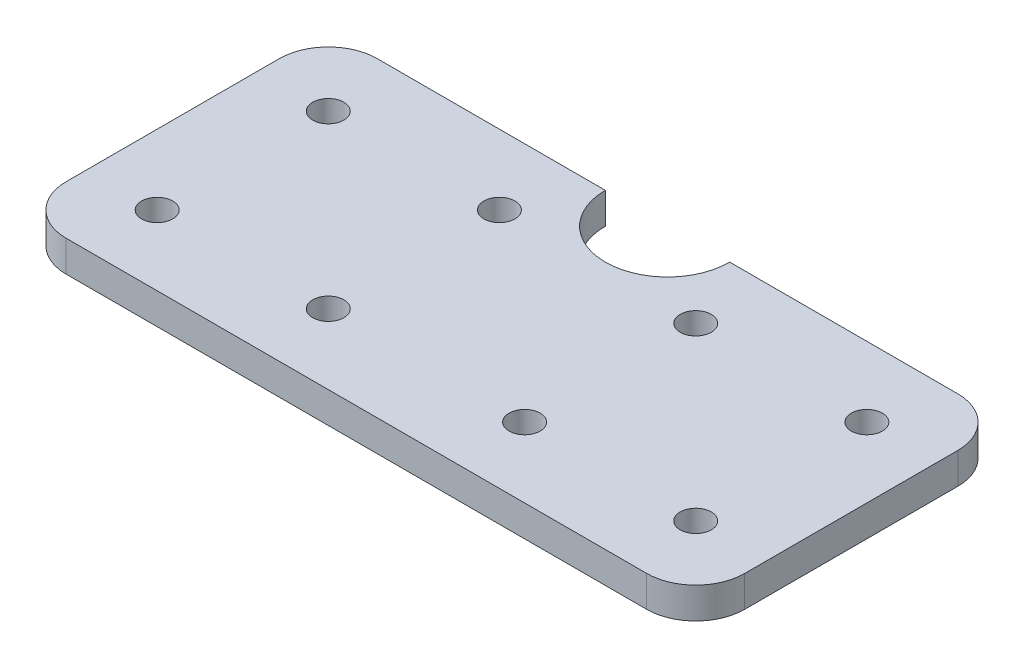
ISO-10303-21;
HEADER;
FILE_DESCRIPTION(('STEP AP214'),'2;1');
FILE_NAME('part.step','',(''),(''),'','','');
FILE_SCHEMA(('AUTOMOTIVE_DESIGN { 1 0 10303 214 1 1 1 1 }'));
ENDSEC;
DATA;
#1=APPLICATION_CONTEXT('core data for automotive mechanical design processes');
#2=APPLICATION_PROTOCOL_DEFINITION('international standard','automotive_design',2000,#1);
#3=PRODUCT_CONTEXT('',#1,'mechanical');
#4=PRODUCT('Part','Part','',(#3));
#5=PRODUCT_RELATED_PRODUCT_CATEGORY('part','',(#4));
#6=PRODUCT_DEFINITION_FORMATION('','',#4);
#7=PRODUCT_DEFINITION_CONTEXT('part definition',#1,'design');
#8=PRODUCT_DEFINITION('design','',#6,#7);
#9=PRODUCT_DEFINITION_SHAPE('','',#8);
#10=(LENGTH_UNIT() NAMED_UNIT(*) SI_UNIT(.MILLI.,.METRE.));
#11=(NAMED_UNIT(*) PLANE_ANGLE_UNIT() SI_UNIT($,.RADIAN.));
#12=(NAMED_UNIT(*) SI_UNIT($,.STERADIAN.) SOLID_ANGLE_UNIT());
#13=UNCERTAINTY_MEASURE_WITH_UNIT(LENGTH_MEASURE(1.E-05),#10,'distance_accuracy_value','');
#14=(GEOMETRIC_REPRESENTATION_CONTEXT(3) GLOBAL_UNCERTAINTY_ASSIGNED_CONTEXT((#13)) GLOBAL_UNIT_ASSIGNED_CONTEXT((#10,
#11,#12)) REPRESENTATION_CONTEXT('',''));
#15=CARTESIAN_POINT('',(0.,0.,0.));
#16=DIRECTION('',(0.,0.,1.));
#17=DIRECTION('',(1.,0.,0.));
#18=AXIS2_PLACEMENT_3D('',#15,#16,#17);
#19=CARTESIAN_POINT('',(-69.25,6.35,-31.75));
#20=DIRECTION('',(0.,0.,1.));
#21=DIRECTION('',(1.,0.,0.));
#22=AXIS2_PLACEMENT_3D('',#19,#20,#21);
#23=PLANE('',#22);
#24=DIRECTION('',(-1.,0.,0.));
#25=VECTOR('',#24,1.);
#26=CARTESIAN_POINT('',(-69.25,0.,-31.75));
#27=LINE('',#26,#25);
#28=CARTESIAN_POINT('',(59.25,0.,-31.75));
#29=VERTEX_POINT('',#28);
#30=CARTESIAN_POINT('',(12.7,0.,-31.75));
#31=VERTEX_POINT('',#30);
#32=EDGE_CURVE('E139',#29,#31,#27,.T.);
#33=ORIENTED_EDGE('',*,*,#32,.T.);
#34=DIRECTION('',(0.,1.,0.));
#35=VECTOR('',#34,1.);
#36=CARTESIAN_POINT('',(12.7,0.,-31.75));
#37=LINE('',#36,#35);
#38=CARTESIAN_POINT('',(12.7,6.35,-31.75));
#39=VERTEX_POINT('',#38);
#40=EDGE_CURVE('E55',#31,#39,#37,.T.);
#41=ORIENTED_EDGE('',*,*,#40,.T.);
#42=DIRECTION('',(-1.,0.,0.));
#43=VECTOR('',#42,1.);
#44=CARTESIAN_POINT('',(-69.25,6.35,-31.75));
#45=LINE('',#44,#43);
#46=CARTESIAN_POINT('',(59.25,6.35,-31.75));
#47=VERTEX_POINT('',#46);
#48=EDGE_CURVE('E216',#47,#39,#45,.T.);
#49=ORIENTED_EDGE('',*,*,#48,.F.);
#50=DIRECTION('',(0.,-1.,0.));
#51=VECTOR('',#50,1.);
#52=CARTESIAN_POINT('',(59.25,6.35,-31.75));
#53=LINE('',#52,#51);
#54=EDGE_CURVE('E11',#47,#29,#53,.T.);
#55=ORIENTED_EDGE('',*,*,#54,.T.);
#56=EDGE_LOOP('',(#33,#41,#49,#55));
#57=FACE_BOUND('',#56,.T.);
#58=ADVANCED_FACE('F39',(#57),#23,.F.);
#59=CARTESIAN_POINT('',(69.25,6.35,31.75));
#60=DIRECTION('',(-1.,0.,0.));
#61=DIRECTION('',(0.,0.,1.));
#62=AXIS2_PLACEMENT_3D('',#59,#60,#61);
#63=PLANE('',#62);
#64=DIRECTION('',(0.,0.,-1.));
#65=VECTOR('',#64,1.);
#66=CARTESIAN_POINT('',(69.25,6.35,31.75));
#67=LINE('',#66,#65);
#68=CARTESIAN_POINT('',(69.25,6.35,21.75));
#69=VERTEX_POINT('',#68);
#70=CARTESIAN_POINT('',(69.25,6.35,-21.75));
#71=VERTEX_POINT('',#70);
#72=EDGE_CURVE('E157',#69,#71,#67,.T.);
#73=ORIENTED_EDGE('',*,*,#72,.F.);
#74=DIRECTION('',(0.,-1.,0.));
#75=VECTOR('',#74,1.);
#76=CARTESIAN_POINT('',(69.25,6.35,21.75));
#77=LINE('',#76,#75);
#78=CARTESIAN_POINT('',(69.25,0.,21.75));
#79=VERTEX_POINT('',#78);
#80=EDGE_CURVE('E199',#69,#79,#77,.T.);
#81=ORIENTED_EDGE('',*,*,#80,.T.);
#82=DIRECTION('',(0.,0.,-1.));
#83=VECTOR('',#82,1.);
#84=CARTESIAN_POINT('',(69.25,0.,31.75));
#85=LINE('',#84,#83);
#86=CARTESIAN_POINT('',(69.25,0.,-21.75));
#87=VERTEX_POINT('',#86);
#88=EDGE_CURVE('E140',#79,#87,#85,.T.);
#89=ORIENTED_EDGE('',*,*,#88,.T.);
#90=DIRECTION('',(0.,-1.,0.));
#91=VECTOR('',#90,1.);
#92=CARTESIAN_POINT('',(69.25,6.35,-21.75));
#93=LINE('',#92,#91);
#94=EDGE_CURVE('E196',#87,#71,#93,.F.);
#95=ORIENTED_EDGE('',*,*,#94,.T.);
#96=EDGE_LOOP('',(#73,#81,#89,#95));
#97=FACE_BOUND('',#96,.T.);
#98=ADVANCED_FACE('F301',(#97),#63,.F.);
#99=CARTESIAN_POINT('',(-12.7,6.35,-31.75));
#100=VERTEX_POINT('',#99);
#101=CARTESIAN_POINT('',(-59.25,6.35,-31.75));
#102=VERTEX_POINT('',#101);
#103=EDGE_CURVE('E63',#100,#102,#45,.T.);
#104=ORIENTED_EDGE('',*,*,#103,.F.);
#105=DIRECTION('',(0.,1.,0.));
#106=VECTOR('',#105,1.);
#107=CARTESIAN_POINT('',(-12.7,0.,-31.75));
#108=LINE('',#107,#106);
#109=CARTESIAN_POINT('',(-12.7,0.,-31.75));
#110=VERTEX_POINT('',#109);
#111=EDGE_CURVE('E118',#110,#100,#108,.T.);
#112=ORIENTED_EDGE('',*,*,#111,.F.);
#113=CARTESIAN_POINT('',(-59.25,0.,-31.75));
#114=VERTEX_POINT('',#113);
#115=EDGE_CURVE('E128',#110,#114,#27,.T.);
#116=ORIENTED_EDGE('',*,*,#115,.T.);
#117=DIRECTION('',(0.,-1.,0.));
#118=VECTOR('',#117,1.);
#119=CARTESIAN_POINT('',(-59.25,6.35,-31.75));
#120=LINE('',#119,#118);
#121=EDGE_CURVE('E48',#114,#102,#120,.F.);
#122=ORIENTED_EDGE('',*,*,#121,.T.);
#123=EDGE_LOOP('',(#104,#112,#116,#122));
#124=FACE_BOUND('',#123,.T.);
#125=ADVANCED_FACE('F127',(#124),#23,.F.);
#126=CARTESIAN_POINT('',(-69.25,6.35,31.75));
#127=DIRECTION('',(1.,0.,0.));
#128=DIRECTION('',(0.,0.,-1.));
#129=AXIS2_PLACEMENT_3D('',#126,#127,#128);
#130=PLANE('',#129);
#131=DIRECTION('',(0.,0.,1.));
#132=VECTOR('',#131,1.);
#133=CARTESIAN_POINT('',(-69.25,0.,31.75));
#134=LINE('',#133,#132);
#135=CARTESIAN_POINT('',(-69.25,0.,-21.75));
#136=VERTEX_POINT('',#135);
#137=CARTESIAN_POINT('',(-69.25,0.,21.75));
#138=VERTEX_POINT('',#137);
#139=EDGE_CURVE('E144',#136,#138,#134,.T.);
#140=ORIENTED_EDGE('',*,*,#139,.T.);
#141=DIRECTION('',(0.,-1.,0.));
#142=VECTOR('',#141,1.);
#143=CARTESIAN_POINT('',(-69.25,6.35,21.75));
#144=LINE('',#143,#142);
#145=CARTESIAN_POINT('',(-69.25,6.35,21.75));
#146=VERTEX_POINT('',#145);
#147=EDGE_CURVE('E181',#138,#146,#144,.F.);
#148=ORIENTED_EDGE('',*,*,#147,.T.);
#149=DIRECTION('',(0.,0.,1.));
#150=VECTOR('',#149,1.);
#151=CARTESIAN_POINT('',(-69.25,6.35,31.75));
#152=LINE('',#151,#150);
#153=CARTESIAN_POINT('',(-69.25,6.35,-21.75));
#154=VERTEX_POINT('',#153);
#155=EDGE_CURVE('E210',#154,#146,#152,.T.);
#156=ORIENTED_EDGE('',*,*,#155,.F.);
#157=DIRECTION('',(0.,-1.,0.));
#158=VECTOR('',#157,1.);
#159=CARTESIAN_POINT('',(-69.25,6.35,-21.75));
#160=LINE('',#159,#158);
#161=EDGE_CURVE('E177',#154,#136,#160,.T.);
#162=ORIENTED_EDGE('',*,*,#161,.T.);
#163=EDGE_LOOP('',(#140,#148,#156,#162));
#164=FACE_BOUND('',#163,.T.);
#165=ADVANCED_FACE('F213',(#164),#130,.F.);
#166=CARTESIAN_POINT('',(-69.25,6.35,31.75));
#167=DIRECTION('',(0.,0.,-1.));
#168=DIRECTION('',(-1.,0.,0.));
#169=AXIS2_PLACEMENT_3D('',#166,#167,#168);
#170=PLANE('',#169);
#171=DIRECTION('',(1.,0.,0.));
#172=VECTOR('',#171,1.);
#173=CARTESIAN_POINT('',(-69.25,6.35,31.75));
#174=LINE('',#173,#172);
#175=CARTESIAN_POINT('',(-59.25,6.35,31.75));
#176=VERTEX_POINT('',#175);
#177=CARTESIAN_POINT('',(59.25,6.35,31.75));
#178=VERTEX_POINT('',#177);
#179=EDGE_CURVE('E162',#176,#178,#174,.T.);
#180=ORIENTED_EDGE('',*,*,#179,.F.);
#181=DIRECTION('',(0.,-1.,0.));
#182=VECTOR('',#181,1.);
#183=CARTESIAN_POINT('',(-59.25,6.35,31.75));
#184=LINE('',#183,#182);
#185=CARTESIAN_POINT('',(-59.25,0.,31.75));
#186=VERTEX_POINT('',#185);
#187=EDGE_CURVE('E161',#176,#186,#184,.T.);
#188=ORIENTED_EDGE('',*,*,#187,.T.);
#189=DIRECTION('',(1.,0.,0.));
#190=VECTOR('',#189,1.);
#191=CARTESIAN_POINT('',(-69.25,0.,31.75));
#192=LINE('',#191,#190);
#193=CARTESIAN_POINT('',(59.25,0.,31.75));
#194=VERTEX_POINT('',#193);
#195=EDGE_CURVE('E153',#186,#194,#192,.T.);
#196=ORIENTED_EDGE('',*,*,#195,.T.);
#197=DIRECTION('',(0.,-1.,0.));
#198=VECTOR('',#197,1.);
#199=CARTESIAN_POINT('',(59.25,6.35,31.75));
#200=LINE('',#199,#198);
#201=EDGE_CURVE('E158',#194,#178,#200,.F.);
#202=ORIENTED_EDGE('',*,*,#201,.T.);
#203=EDGE_LOOP('',(#180,#188,#196,#202));
#204=FACE_BOUND('',#203,.T.);
#205=ADVANCED_FACE('F310',(#204),#170,.F.);
#206=CARTESIAN_POINT('',(0.,6.35,0.));
#207=DIRECTION('',(0.,-1.,0.));
#208=DIRECTION('',(0.,0.,-1.));
#209=AXIS2_PLACEMENT_3D('',#206,#207,#208);
#210=PLANE('',#209);
#211=CARTESIAN_POINT('',(-20.0375,6.35,-17.4625));
#212=DIRECTION('',(0.,1.,0.));
#213=DIRECTION('',(0.,0.,1.));
#214=AXIS2_PLACEMENT_3D('',#211,#212,#213);
#215=CIRCLE('',#214,3.175);
#216=CARTESIAN_POINT('',(-20.0375,6.35,-14.2875));
#217=VERTEX_POINT('',#216);
#218=EDGE_CURVE('E259',#217,#217,#215,.T.);
#219=ORIENTED_EDGE('',*,*,#218,.F.);
#220=EDGE_LOOP('',(#219));
#221=FACE_BOUND('',#220,.T.);
#222=CARTESIAN_POINT('',(20.0375,6.35,-17.4625));
#223=DIRECTION('',(0.,1.,0.));
#224=DIRECTION('',(0.,0.,-1.));
#225=AXIS2_PLACEMENT_3D('',#222,#223,#224);
#226=CIRCLE('',#225,3.175);
#227=CARTESIAN_POINT('',(20.0375,6.35,-20.6375));
#228=VERTEX_POINT('',#227);
#229=EDGE_CURVE('E251',#228,#228,#226,.T.);
#230=ORIENTED_EDGE('',*,*,#229,.F.);
#231=EDGE_LOOP('',(#230));
#232=FACE_BOUND('',#231,.T.);
#233=CARTESIAN_POINT('',(54.9625,6.35,-17.4625));
#234=DIRECTION('',(0.,1.,0.));
#235=DIRECTION('',(0.,0.,-1.));
#236=AXIS2_PLACEMENT_3D('',#233,#234,#235);
#237=CIRCLE('',#236,3.175);
#238=CARTESIAN_POINT('',(54.9625,6.35,-20.6375));
#239=VERTEX_POINT('',#238);
#240=EDGE_CURVE('E243',#239,#239,#237,.T.);
#241=ORIENTED_EDGE('',*,*,#240,.F.);
#242=EDGE_LOOP('',(#241));
#243=FACE_BOUND('',#242,.T.);
#244=CARTESIAN_POINT('',(54.9625,6.35,17.4625));
#245=DIRECTION('',(0.,1.,0.));
#246=DIRECTION('',(0.,0.,1.));
#247=AXIS2_PLACEMENT_3D('',#244,#245,#246);
#248=CIRCLE('',#247,3.175);
#249=CARTESIAN_POINT('',(54.9625,6.35,20.6375));
#250=VERTEX_POINT('',#249);
#251=EDGE_CURVE('E234',#250,#250,#248,.T.);
#252=ORIENTED_EDGE('',*,*,#251,.F.);
#253=EDGE_LOOP('',(#252));
#254=FACE_BOUND('',#253,.T.);
#255=CARTESIAN_POINT('',(20.0375,6.35,17.4625));
#256=DIRECTION('',(0.,1.,0.));
#257=DIRECTION('',(0.,0.,1.));
#258=AXIS2_PLACEMENT_3D('',#255,#256,#257);
#259=CIRCLE('',#258,3.175);
#260=CARTESIAN_POINT('',(20.0375,6.35,20.6375));
#261=VERTEX_POINT('',#260);
#262=EDGE_CURVE('E281',#261,#261,#259,.T.);
#263=ORIENTED_EDGE('',*,*,#262,.F.);
#264=EDGE_LOOP('',(#263));
#265=FACE_BOUND('',#264,.T.);
#266=CARTESIAN_POINT('',(-20.0375,6.35,17.4625));
#267=DIRECTION('',(0.,1.,0.));
#268=DIRECTION('',(0.,0.,-1.));
#269=AXIS2_PLACEMENT_3D('',#266,#267,#268);
#270=CIRCLE('',#269,3.175);
#271=CARTESIAN_POINT('',(-20.0375,6.35,14.2875));
#272=VERTEX_POINT('',#271);
#273=EDGE_CURVE('E273',#272,#272,#270,.T.);
#274=ORIENTED_EDGE('',*,*,#273,.F.);
#275=EDGE_LOOP('',(#274));
#276=FACE_BOUND('',#275,.T.);
#277=CARTESIAN_POINT('',(-54.9625,6.35,17.4625));
#278=DIRECTION('',(0.,1.,0.));
#279=DIRECTION('',(0.,0.,-1.));
#280=AXIS2_PLACEMENT_3D('',#277,#278,#279);
#281=CIRCLE('',#280,3.175);
#282=CARTESIAN_POINT('',(-54.9625,6.35,14.2875));
#283=VERTEX_POINT('',#282);
#284=EDGE_CURVE('E131',#283,#283,#281,.T.);
#285=ORIENTED_EDGE('',*,*,#284,.F.);
#286=EDGE_LOOP('',(#285));
#287=FACE_BOUND('',#286,.T.);
#288=CARTESIAN_POINT('',(-54.9625,6.35,-17.4625));
#289=DIRECTION('',(0.,1.,0.));
#290=DIRECTION('',(0.,0.,1.));
#291=AXIS2_PLACEMENT_3D('',#288,#289,#290);
#292=CIRCLE('',#291,3.175);
#293=CARTESIAN_POINT('',(-54.9625,6.35,-14.2875));
#294=VERTEX_POINT('',#293);
#295=EDGE_CURVE('E226',#294,#294,#292,.T.);
#296=ORIENTED_EDGE('',*,*,#295,.F.);
#297=EDGE_LOOP('',(#296));
#298=FACE_BOUND('',#297,.T.);
#299=ORIENTED_EDGE('',*,*,#48,.T.);
#300=CARTESIAN_POINT('',(0.,6.35,-31.75));
#301=DIRECTION('',(0.,1.,0.));
#302=DIRECTION('',(0.,0.,-1.));
#303=AXIS2_PLACEMENT_3D('',#300,#301,#302);
#304=CIRCLE('',#303,12.7);
#305=EDGE_CURVE('E124',#100,#39,#304,.T.);
#306=ORIENTED_EDGE('',*,*,#305,.F.);
#307=ORIENTED_EDGE('',*,*,#103,.T.);
#308=CARTESIAN_POINT('',(-59.25,6.35,-21.75));
#309=DIRECTION('',(0.,-1.,0.));
#310=DIRECTION('',(0.,0.,-1.));
#311=AXIS2_PLACEMENT_3D('',#308,#309,#310);
#312=CIRCLE('',#311,10.);
#313=EDGE_CURVE('E184',#102,#154,#312,.F.);
#314=ORIENTED_EDGE('',*,*,#313,.T.);
#315=ORIENTED_EDGE('',*,*,#155,.T.);
#316=CARTESIAN_POINT('',(-59.25,6.35,21.75));
#317=DIRECTION('',(0.,-1.,0.));
#318=DIRECTION('',(0.,0.,-1.));
#319=AXIS2_PLACEMENT_3D('',#316,#317,#318);
#320=CIRCLE('',#319,10.);
#321=EDGE_CURVE('E193',#146,#176,#320,.F.);
#322=ORIENTED_EDGE('',*,*,#321,.T.);
#323=ORIENTED_EDGE('',*,*,#179,.T.);
#324=CARTESIAN_POINT('',(59.25,6.35,21.75));
#325=DIRECTION('',(0.,-1.,0.));
#326=DIRECTION('',(0.,0.,-1.));
#327=AXIS2_PLACEMENT_3D('',#324,#325,#326);
#328=CIRCLE('',#327,10.);
#329=EDGE_CURVE('E190',#178,#69,#328,.F.);
#330=ORIENTED_EDGE('',*,*,#329,.T.);
#331=ORIENTED_EDGE('',*,*,#72,.T.);
#332=CARTESIAN_POINT('',(59.25,6.35,-21.75));
#333=DIRECTION('',(0.,-1.,0.));
#334=DIRECTION('',(0.,0.,-1.));
#335=AXIS2_PLACEMENT_3D('',#332,#333,#334);
#336=CIRCLE('',#335,10.);
#337=EDGE_CURVE('E187',#71,#47,#336,.F.);
#338=ORIENTED_EDGE('',*,*,#337,.T.);
#339=EDGE_LOOP('',(#299,#306,#307,#314,#315,#322,#323,#330,#331,#338));
#340=FACE_BOUND('',#339,.T.);
#341=ADVANCED_FACE('F209',(#221,#232,#243,#254,#265,#276,#287,#298,#340),#210,.F.);
#342=CARTESIAN_POINT('',(0.,0.,0.));
#343=DIRECTION('',(0.,-1.,0.));
#344=DIRECTION('',(0.,0.,-1.));
#345=AXIS2_PLACEMENT_3D('',#342,#343,#344);
#346=PLANE('',#345);
#347=CARTESIAN_POINT('',(0.,0.,-31.75));
#348=DIRECTION('',(0.,1.,0.));
#349=DIRECTION('',(0.,0.,-1.));
#350=AXIS2_PLACEMENT_3D('',#347,#348,#349);
#351=CIRCLE('',#350,12.7);
#352=EDGE_CURVE('E115',#110,#31,#351,.T.);
#353=ORIENTED_EDGE('',*,*,#352,.T.);
#354=ORIENTED_EDGE('',*,*,#32,.F.);
#355=CARTESIAN_POINT('',(59.25,0.,-21.75));
#356=DIRECTION('',(0.,-1.,0.));
#357=DIRECTION('',(0.,0.,-1.));
#358=AXIS2_PLACEMENT_3D('',#355,#356,#357);
#359=CIRCLE('',#358,10.);
#360=EDGE_CURVE('E168',#29,#87,#359,.T.);
#361=ORIENTED_EDGE('',*,*,#360,.T.);
#362=ORIENTED_EDGE('',*,*,#88,.F.);
#363=CARTESIAN_POINT('',(59.25,0.,21.75));
#364=DIRECTION('',(0.,-1.,0.));
#365=DIRECTION('',(0.,0.,-1.));
#366=AXIS2_PLACEMENT_3D('',#363,#364,#365);
#367=CIRCLE('',#366,10.);
#368=EDGE_CURVE('E171',#79,#194,#367,.T.);
#369=ORIENTED_EDGE('',*,*,#368,.T.);
#370=ORIENTED_EDGE('',*,*,#195,.F.);
#371=CARTESIAN_POINT('',(-59.25,0.,21.75));
#372=DIRECTION('',(0.,-1.,0.));
#373=DIRECTION('',(0.,0.,-1.));
#374=AXIS2_PLACEMENT_3D('',#371,#372,#373);
#375=CIRCLE('',#374,10.);
#376=EDGE_CURVE('E174',#186,#138,#375,.T.);
#377=ORIENTED_EDGE('',*,*,#376,.T.);
#378=ORIENTED_EDGE('',*,*,#139,.F.);
#379=CARTESIAN_POINT('',(-59.25,0.,-21.75));
#380=DIRECTION('',(0.,-1.,0.));
#381=DIRECTION('',(0.,0.,-1.));
#382=AXIS2_PLACEMENT_3D('',#379,#380,#381);
#383=CIRCLE('',#382,10.);
#384=EDGE_CURVE('E136',#136,#114,#383,.T.);
#385=ORIENTED_EDGE('',*,*,#384,.T.);
#386=ORIENTED_EDGE('',*,*,#115,.F.);
#387=EDGE_LOOP('',(#353,#354,#361,#362,#369,#370,#377,#378,#385,#386));
#388=FACE_BOUND('',#387,.T.);
#389=CARTESIAN_POINT('',(-20.0375,0.,-17.4625));
#390=DIRECTION('',(0.,1.,0.));
#391=DIRECTION('',(0.,0.,1.));
#392=AXIS2_PLACEMENT_3D('',#389,#390,#391);
#393=CIRCLE('',#392,3.175);
#394=CARTESIAN_POINT('',(-20.0375,0.,-14.2875));
#395=VERTEX_POINT('',#394);
#396=EDGE_CURVE('E230',#395,#395,#393,.T.);
#397=ORIENTED_EDGE('',*,*,#396,.T.);
#398=EDGE_LOOP('',(#397));
#399=FACE_BOUND('',#398,.T.);
#400=CARTESIAN_POINT('',(20.0375,0.,-17.4625));
#401=DIRECTION('',(0.,1.,0.));
#402=DIRECTION('',(0.,0.,-1.));
#403=AXIS2_PLACEMENT_3D('',#400,#401,#402);
#404=CIRCLE('',#403,3.175);
#405=CARTESIAN_POINT('',(20.0375,0.,-20.6375));
#406=VERTEX_POINT('',#405);
#407=EDGE_CURVE('E255',#406,#406,#404,.T.);
#408=ORIENTED_EDGE('',*,*,#407,.T.);
#409=EDGE_LOOP('',(#408));
#410=FACE_BOUND('',#409,.T.);
#411=CARTESIAN_POINT('',(54.9625,0.,-17.4625));
#412=DIRECTION('',(0.,1.,0.));
#413=DIRECTION('',(0.,0.,-1.));
#414=AXIS2_PLACEMENT_3D('',#411,#412,#413);
#415=CIRCLE('',#414,3.175);
#416=CARTESIAN_POINT('',(54.9625,0.,-20.6375));
#417=VERTEX_POINT('',#416);
#418=EDGE_CURVE('E247',#417,#417,#415,.T.);
#419=ORIENTED_EDGE('',*,*,#418,.T.);
#420=EDGE_LOOP('',(#419));
#421=FACE_BOUND('',#420,.T.);
#422=CARTESIAN_POINT('',(54.9625,0.,17.4625));
#423=DIRECTION('',(0.,1.,0.));
#424=DIRECTION('',(0.,0.,1.));
#425=AXIS2_PLACEMENT_3D('',#422,#423,#424);
#426=CIRCLE('',#425,3.175);
#427=CARTESIAN_POINT('',(54.9625,0.,20.6375));
#428=VERTEX_POINT('',#427);
#429=EDGE_CURVE('E238',#428,#428,#426,.T.);
#430=ORIENTED_EDGE('',*,*,#429,.T.);
#431=EDGE_LOOP('',(#430));
#432=FACE_BOUND('',#431,.T.);
#433=CARTESIAN_POINT('',(20.0375,0.,17.4625));
#434=DIRECTION('',(0.,1.,0.));
#435=DIRECTION('',(0.,0.,1.));
#436=AXIS2_PLACEMENT_3D('',#433,#434,#435);
#437=CIRCLE('',#436,3.175);
#438=CARTESIAN_POINT('',(20.0375,0.,20.6375));
#439=VERTEX_POINT('',#438);
#440=EDGE_CURVE('E239',#439,#439,#437,.T.);
#441=ORIENTED_EDGE('',*,*,#440,.T.);
#442=EDGE_LOOP('',(#441));
#443=FACE_BOUND('',#442,.T.);
#444=CARTESIAN_POINT('',(-20.0375,0.,17.4625));
#445=DIRECTION('',(0.,1.,0.));
#446=DIRECTION('',(0.,0.,-1.));
#447=AXIS2_PLACEMENT_3D('',#444,#445,#446);
#448=CIRCLE('',#447,3.175);
#449=CARTESIAN_POINT('',(-20.0375,0.,14.2875));
#450=VERTEX_POINT('',#449);
#451=EDGE_CURVE('E277',#450,#450,#448,.T.);
#452=ORIENTED_EDGE('',*,*,#451,.T.);
#453=EDGE_LOOP('',(#452));
#454=FACE_BOUND('',#453,.T.);
#455=CARTESIAN_POINT('',(-54.9625,0.,17.4625));
#456=DIRECTION('',(0.,1.,0.));
#457=DIRECTION('',(0.,0.,-1.));
#458=AXIS2_PLACEMENT_3D('',#455,#456,#457);
#459=CIRCLE('',#458,3.175);
#460=CARTESIAN_POINT('',(-54.9625,0.,14.2875));
#461=VERTEX_POINT('',#460);
#462=EDGE_CURVE('E269',#461,#461,#459,.T.);
#463=ORIENTED_EDGE('',*,*,#462,.T.);
#464=EDGE_LOOP('',(#463));
#465=FACE_BOUND('',#464,.T.);
#466=CARTESIAN_POINT('',(-54.9625,0.,-17.4625));
#467=DIRECTION('',(0.,1.,0.));
#468=DIRECTION('',(0.,0.,1.));
#469=AXIS2_PLACEMENT_3D('',#466,#467,#468);
#470=CIRCLE('',#469,3.175);
#471=CARTESIAN_POINT('',(-54.9625,0.,-14.2875));
#472=VERTEX_POINT('',#471);
#473=EDGE_CURVE('E146',#472,#472,#470,.T.);
#474=ORIENTED_EDGE('',*,*,#473,.T.);
#475=EDGE_LOOP('',(#474));
#476=FACE_BOUND('',#475,.T.);
#477=ADVANCED_FACE('F133',(#388,#399,#410,#421,#432,#443,#454,#465,#476),#346,.T.);
#478=CARTESIAN_POINT('',(-54.9625,0.,-17.4625));
#479=DIRECTION('',(0.,1.,0.));
#480=DIRECTION('',(0.,0.,1.));
#481=AXIS2_PLACEMENT_3D('',#478,#479,#480);
#482=CYLINDRICAL_SURFACE('',#481,3.175);
#483=ORIENTED_EDGE('',*,*,#473,.F.);
#484=EDGE_LOOP('',(#483));
#485=FACE_BOUND('',#484,.T.);
#486=ORIENTED_EDGE('',*,*,#295,.T.);
#487=EDGE_LOOP('',(#486));
#488=FACE_BOUND('',#487,.T.);
#489=ADVANCED_FACE('F343',(#485,#488),#482,.F.);
#490=CARTESIAN_POINT('',(-54.9625,0.,17.4625));
#491=DIRECTION('',(0.,1.,0.));
#492=DIRECTION('',(0.,0.,1.));
#493=AXIS2_PLACEMENT_3D('',#490,#491,#492);
#494=CYLINDRICAL_SURFACE('',#493,3.175);
#495=ORIENTED_EDGE('',*,*,#462,.F.);
#496=EDGE_LOOP('',(#495));
#497=FACE_BOUND('',#496,.T.);
#498=ORIENTED_EDGE('',*,*,#284,.T.);
#499=EDGE_LOOP('',(#498));
#500=FACE_BOUND('',#499,.T.);
#501=ADVANCED_FACE('F349',(#497,#500),#494,.F.);
#502=CARTESIAN_POINT('',(-20.0375,0.,17.4625));
#503=DIRECTION('',(0.,1.,0.));
#504=DIRECTION('',(0.,0.,1.));
#505=AXIS2_PLACEMENT_3D('',#502,#503,#504);
#506=CYLINDRICAL_SURFACE('',#505,3.175);
#507=ORIENTED_EDGE('',*,*,#451,.F.);
#508=EDGE_LOOP('',(#507));
#509=FACE_BOUND('',#508,.T.);
#510=ORIENTED_EDGE('',*,*,#273,.T.);
#511=EDGE_LOOP('',(#510));
#512=FACE_BOUND('',#511,.T.);
#513=ADVANCED_FACE('F365',(#509,#512),#506,.F.);
#514=CARTESIAN_POINT('',(20.0375,0.,17.4625));
#515=DIRECTION('',(0.,1.,0.));
#516=DIRECTION('',(0.,0.,1.));
#517=AXIS2_PLACEMENT_3D('',#514,#515,#516);
#518=CYLINDRICAL_SURFACE('',#517,3.175);
#519=ORIENTED_EDGE('',*,*,#440,.F.);
#520=EDGE_LOOP('',(#519));
#521=FACE_BOUND('',#520,.T.);
#522=ORIENTED_EDGE('',*,*,#262,.T.);
#523=EDGE_LOOP('',(#522));
#524=FACE_BOUND('',#523,.T.);
#525=ADVANCED_FACE('F355',(#521,#524),#518,.F.);
#526=CARTESIAN_POINT('',(54.9625,0.,17.4625));
#527=DIRECTION('',(0.,1.,0.));
#528=DIRECTION('',(0.,0.,1.));
#529=AXIS2_PLACEMENT_3D('',#526,#527,#528);
#530=CYLINDRICAL_SURFACE('',#529,3.175);
#531=ORIENTED_EDGE('',*,*,#429,.F.);
#532=EDGE_LOOP('',(#531));
#533=FACE_BOUND('',#532,.T.);
#534=ORIENTED_EDGE('',*,*,#251,.T.);
#535=EDGE_LOOP('',(#534));
#536=FACE_BOUND('',#535,.T.);
#537=ADVANCED_FACE('F351',(#533,#536),#530,.F.);
#538=CARTESIAN_POINT('',(54.9625,0.,-17.4625));
#539=DIRECTION('',(0.,1.,0.));
#540=DIRECTION('',(0.,0.,1.));
#541=AXIS2_PLACEMENT_3D('',#538,#539,#540);
#542=CYLINDRICAL_SURFACE('',#541,3.175);
#543=ORIENTED_EDGE('',*,*,#418,.F.);
#544=EDGE_LOOP('',(#543));
#545=FACE_BOUND('',#544,.T.);
#546=ORIENTED_EDGE('',*,*,#240,.T.);
#547=EDGE_LOOP('',(#546));
#548=FACE_BOUND('',#547,.T.);
#549=ADVANCED_FACE('F354',(#545,#548),#542,.F.);
#550=CARTESIAN_POINT('',(20.0375,0.,-17.4625));
#551=DIRECTION('',(0.,1.,0.));
#552=DIRECTION('',(0.,0.,1.));
#553=AXIS2_PLACEMENT_3D('',#550,#551,#552);
#554=CYLINDRICAL_SURFACE('',#553,3.175);
#555=ORIENTED_EDGE('',*,*,#407,.F.);
#556=EDGE_LOOP('',(#555));
#557=FACE_BOUND('',#556,.T.);
#558=ORIENTED_EDGE('',*,*,#229,.T.);
#559=EDGE_LOOP('',(#558));
#560=FACE_BOUND('',#559,.T.);
#561=ADVANCED_FACE('F322',(#557,#560),#554,.F.);
#562=CARTESIAN_POINT('',(-20.0375,0.,-17.4625));
#563=DIRECTION('',(0.,1.,0.));
#564=DIRECTION('',(0.,0.,1.));
#565=AXIS2_PLACEMENT_3D('',#562,#563,#564);
#566=CYLINDRICAL_SURFACE('',#565,3.175);
#567=ORIENTED_EDGE('',*,*,#396,.F.);
#568=EDGE_LOOP('',(#567));
#569=FACE_BOUND('',#568,.T.);
#570=ORIENTED_EDGE('',*,*,#218,.T.);
#571=EDGE_LOOP('',(#570));
#572=FACE_BOUND('',#571,.T.);
#573=ADVANCED_FACE('F315',(#569,#572),#566,.F.);
#574=CARTESIAN_POINT('',(-59.25,6.35,21.75));
#575=DIRECTION('',(0.,-1.,0.));
#576=DIRECTION('',(0.,0.,-1.));
#577=AXIS2_PLACEMENT_3D('',#574,#575,#576);
#578=CYLINDRICAL_SURFACE('',#577,10.);
#579=ORIENTED_EDGE('',*,*,#321,.F.);
#580=ORIENTED_EDGE('',*,*,#147,.F.);
#581=ORIENTED_EDGE('',*,*,#376,.F.);
#582=ORIENTED_EDGE('',*,*,#187,.F.);
#583=EDGE_LOOP('',(#579,#580,#581,#582));
#584=FACE_BOUND('',#583,.T.);
#585=ADVANCED_FACE('F313',(#584),#578,.T.);
#586=CARTESIAN_POINT('',(59.25,6.35,21.75));
#587=DIRECTION('',(0.,-1.,0.));
#588=DIRECTION('',(0.,0.,-1.));
#589=AXIS2_PLACEMENT_3D('',#586,#587,#588);
#590=CYLINDRICAL_SURFACE('',#589,10.);
#591=ORIENTED_EDGE('',*,*,#329,.F.);
#592=ORIENTED_EDGE('',*,*,#201,.F.);
#593=ORIENTED_EDGE('',*,*,#368,.F.);
#594=ORIENTED_EDGE('',*,*,#80,.F.);
#595=EDGE_LOOP('',(#591,#592,#593,#594));
#596=FACE_BOUND('',#595,.T.);
#597=ADVANCED_FACE('F305',(#596),#590,.T.);
#598=CARTESIAN_POINT('',(59.25,6.35,-21.75));
#599=DIRECTION('',(0.,-1.,0.));
#600=DIRECTION('',(0.,0.,-1.));
#601=AXIS2_PLACEMENT_3D('',#598,#599,#600);
#602=CYLINDRICAL_SURFACE('',#601,10.);
#603=ORIENTED_EDGE('',*,*,#337,.F.);
#604=ORIENTED_EDGE('',*,*,#94,.F.);
#605=ORIENTED_EDGE('',*,*,#360,.F.);
#606=ORIENTED_EDGE('',*,*,#54,.F.);
#607=EDGE_LOOP('',(#603,#604,#605,#606));
#608=FACE_BOUND('',#607,.T.);
#609=ADVANCED_FACE('F298',(#608),#602,.T.);
#610=CARTESIAN_POINT('',(-59.25,6.35,-21.75));
#611=DIRECTION('',(0.,-1.,0.));
#612=DIRECTION('',(0.,0.,-1.));
#613=AXIS2_PLACEMENT_3D('',#610,#611,#612);
#614=CYLINDRICAL_SURFACE('',#613,10.);
#615=ORIENTED_EDGE('',*,*,#313,.F.);
#616=ORIENTED_EDGE('',*,*,#121,.F.);
#617=ORIENTED_EDGE('',*,*,#384,.F.);
#618=ORIENTED_EDGE('',*,*,#161,.F.);
#619=EDGE_LOOP('',(#615,#616,#617,#618));
#620=FACE_BOUND('',#619,.T.);
#621=ADVANCED_FACE('F41',(#620),#614,.T.);
#622=CARTESIAN_POINT('',(0.,0.,-31.75));
#623=DIRECTION('',(0.,1.,0.));
#624=DIRECTION('',(0.,0.,1.));
#625=AXIS2_PLACEMENT_3D('',#622,#623,#624);
#626=CYLINDRICAL_SURFACE('',#625,12.7);
#627=ORIENTED_EDGE('',*,*,#305,.T.);
#628=ORIENTED_EDGE('',*,*,#40,.F.);
#629=ORIENTED_EDGE('',*,*,#352,.F.);
#630=ORIENTED_EDGE('',*,*,#111,.T.);
#631=EDGE_LOOP('',(#627,#628,#629,#630));
#632=FACE_BOUND('',#631,.T.);
#633=ADVANCED_FACE('F117',(#632),#626,.F.);
#634=CLOSED_SHELL('',(#58,#98,#125,#165,#205,#341,#477,#489,#501,#513,#525,#537,#549,#561,#573,
#585,#597,#609,#621,#633));
#635=MANIFOLD_SOLID_BREP('B2',#634);
#636=ADVANCED_BREP_SHAPE_REPRESENTATION('',(#18,#635),#14);
#637=SHAPE_DEFINITION_REPRESENTATION(#9,#636);
ENDSEC;
END-ISO-10303-21;
